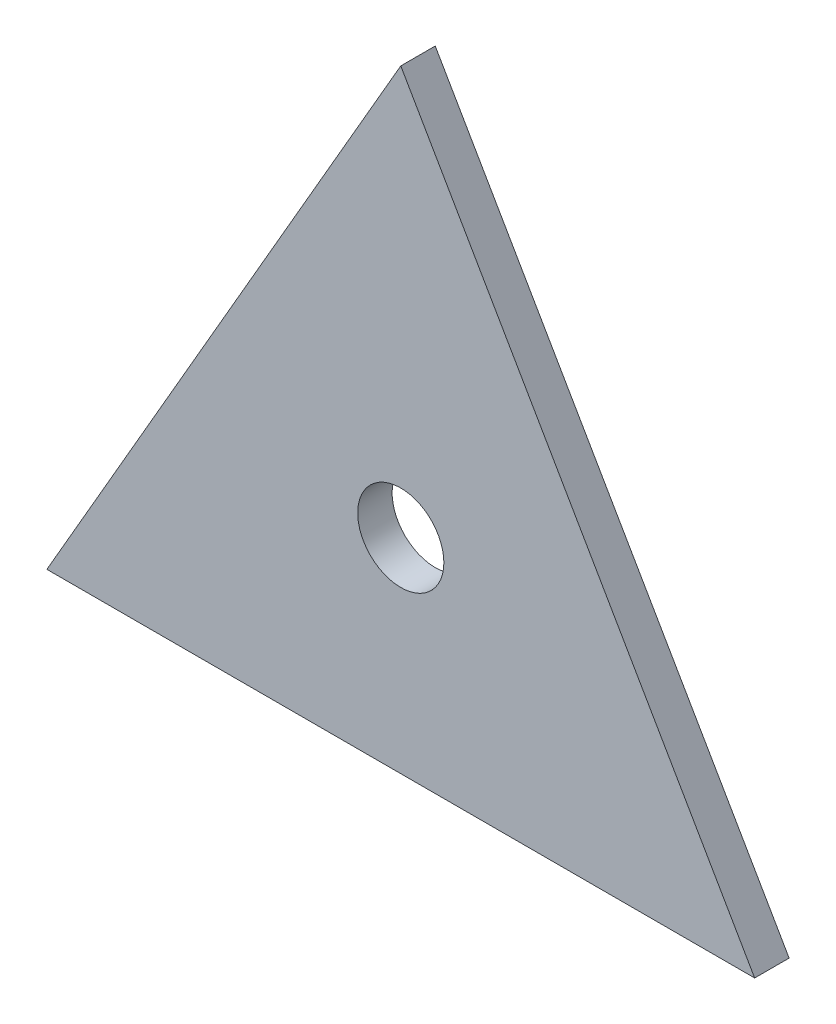
ISO-10303-21;
HEADER;
FILE_DESCRIPTION(('STEP AP214'),'2;1');
FILE_NAME('part.step','',(''),(''),'','','');
FILE_SCHEMA(('AUTOMOTIVE_DESIGN { 1 0 10303 214 1 1 1 1 }'));
ENDSEC;
DATA;
#1=APPLICATION_CONTEXT('core data for automotive mechanical design processes');
#2=APPLICATION_PROTOCOL_DEFINITION('international standard','automotive_design',2000,#1);
#3=PRODUCT_CONTEXT('',#1,'mechanical');
#4=PRODUCT('Part','Part','',(#3));
#5=PRODUCT_RELATED_PRODUCT_CATEGORY('part','',(#4));
#6=PRODUCT_DEFINITION_FORMATION('','',#4);
#7=PRODUCT_DEFINITION_CONTEXT('part definition',#1,'design');
#8=PRODUCT_DEFINITION('design','',#6,#7);
#9=PRODUCT_DEFINITION_SHAPE('','',#8);
#10=(LENGTH_UNIT() NAMED_UNIT(*) SI_UNIT(.MILLI.,.METRE.));
#11=(NAMED_UNIT(*) PLANE_ANGLE_UNIT() SI_UNIT($,.RADIAN.));
#12=(NAMED_UNIT(*) SI_UNIT($,.STERADIAN.) SOLID_ANGLE_UNIT());
#13=UNCERTAINTY_MEASURE_WITH_UNIT(LENGTH_MEASURE(1.E-05),#10,'distance_accuracy_value','');
#14=(GEOMETRIC_REPRESENTATION_CONTEXT(3) GLOBAL_UNCERTAINTY_ASSIGNED_CONTEXT((#13)) GLOBAL_UNIT_ASSIGNED_CONTEXT((#10,
#11,#12)) REPRESENTATION_CONTEXT('',''));
#15=CARTESIAN_POINT('',(0.,0.,0.));
#16=DIRECTION('',(0.,0.,1.));
#17=DIRECTION('',(1.,0.,0.));
#18=AXIS2_PLACEMENT_3D('',#15,#16,#17);
#19=CARTESIAN_POINT('',(-152.400000000001,238.564543073496,-12.7));
#20=DIRECTION('',(-0.866025403784443,0.499999999999993,0.));
#21=DIRECTION('',(-0.499999999999993,-0.866025403784443,0.));
#22=AXIS2_PLACEMENT_3D('',#19,#20,#21);
#23=PLANE('',#22);
#24=DIRECTION('',(-0.499999999999993,-0.866025403784443,0.));
#25=VECTOR('',#24,1.);
#26=CARTESIAN_POINT('',(-152.400000000001,238.564543073496,0.));
#27=LINE('',#26,#25);
#28=CARTESIAN_POINT('',(-152.400000000001,238.564543073496,0.));
#29=VERTEX_POINT('',#28);
#30=CARTESIAN_POINT('',(-282.802954743874,12.6999999999984,0.));
#31=VERTEX_POINT('',#30);
#32=EDGE_CURVE('E88',#29,#31,#27,.T.);
#33=ORIENTED_EDGE('',*,*,#32,.F.);
#34=DIRECTION('',(0.,0.,1.));
#35=VECTOR('',#34,1.);
#36=CARTESIAN_POINT('',(-152.400000000001,238.564543073496,-12.7));
#37=LINE('',#36,#35);
#38=CARTESIAN_POINT('',(-152.400000000001,238.564543073496,-12.7));
#39=VERTEX_POINT('',#38);
#40=EDGE_CURVE('E11',#39,#29,#37,.T.);
#41=ORIENTED_EDGE('',*,*,#40,.F.);
#42=DIRECTION('',(-0.499999999999993,-0.866025403784443,0.));
#43=VECTOR('',#42,1.);
#44=CARTESIAN_POINT('',(-152.400000000001,238.564543073496,-12.7));
#45=LINE('',#44,#43);
#46=CARTESIAN_POINT('',(-282.802954743874,12.6999999999984,-12.7));
#47=VERTEX_POINT('',#46);
#48=EDGE_CURVE('E77',#39,#47,#45,.T.);
#49=ORIENTED_EDGE('',*,*,#48,.T.);
#50=DIRECTION('',(0.,0.,1.));
#51=VECTOR('',#50,1.);
#52=CARTESIAN_POINT('',(-282.802954743874,12.6999999999984,-12.7));
#53=LINE('',#52,#51);
#54=EDGE_CURVE('E36',#47,#31,#53,.T.);
#55=ORIENTED_EDGE('',*,*,#54,.T.);
#56=EDGE_LOOP('',(#33,#41,#49,#55));
#57=FACE_BOUND('',#56,.T.);
#58=ADVANCED_FACE('F33',(#57),#23,.T.);
#59=CARTESIAN_POINT('',(-21.9970452561249,12.7,-12.7));
#60=DIRECTION('',(0.866025403784437,0.500000000000003,0.));
#61=DIRECTION('',(-0.500000000000003,0.866025403784437,0.));
#62=AXIS2_PLACEMENT_3D('',#59,#60,#61);
#63=PLANE('',#62);
#64=DIRECTION('',(-0.500000000000003,0.866025403784437,0.));
#65=VECTOR('',#64,1.);
#66=CARTESIAN_POINT('',(-21.9970452561249,12.7,0.));
#67=LINE('',#66,#65);
#68=CARTESIAN_POINT('',(-21.9970452561249,12.7,0.));
#69=VERTEX_POINT('',#68);
#70=EDGE_CURVE('E79',#69,#29,#67,.T.);
#71=ORIENTED_EDGE('',*,*,#70,.F.);
#72=DIRECTION('',(0.,0.,1.));
#73=VECTOR('',#72,1.);
#74=CARTESIAN_POINT('',(-21.9970452561249,12.7,-12.7));
#75=LINE('',#74,#73);
#76=CARTESIAN_POINT('',(-21.9970452561249,12.7,-12.7));
#77=VERTEX_POINT('',#76);
#78=EDGE_CURVE('E42',#77,#69,#75,.T.);
#79=ORIENTED_EDGE('',*,*,#78,.F.);
#80=DIRECTION('',(-0.500000000000003,0.866025403784437,0.));
#81=VECTOR('',#80,1.);
#82=CARTESIAN_POINT('',(-21.9970452561249,12.7,-12.7));
#83=LINE('',#82,#81);
#84=EDGE_CURVE('E74',#77,#39,#83,.T.);
#85=ORIENTED_EDGE('',*,*,#84,.T.);
#86=ORIENTED_EDGE('',*,*,#40,.T.);
#87=EDGE_LOOP('',(#71,#79,#85,#86));
#88=FACE_BOUND('',#87,.T.);
#89=ADVANCED_FACE('F92',(#88),#63,.T.);
#90=CARTESIAN_POINT('',(-282.802954743874,12.6999999999984,-12.7));
#91=DIRECTION('',(0.,-1.,0.));
#92=DIRECTION('',(1.,0.,0.));
#93=AXIS2_PLACEMENT_3D('',#90,#91,#92);
#94=PLANE('',#93);
#95=DIRECTION('',(1.,0.,0.));
#96=VECTOR('',#95,1.);
#97=CARTESIAN_POINT('',(-282.802954743874,12.6999999999984,0.));
#98=LINE('',#97,#96);
#99=EDGE_CURVE('E72',#31,#69,#98,.T.);
#100=ORIENTED_EDGE('',*,*,#99,.F.);
#101=ORIENTED_EDGE('',*,*,#54,.F.);
#102=DIRECTION('',(1.,0.,0.));
#103=VECTOR('',#102,1.);
#104=CARTESIAN_POINT('',(-282.802954743874,12.6999999999984,-12.7));
#105=LINE('',#104,#103);
#106=EDGE_CURVE('E70',#47,#77,#105,.T.);
#107=ORIENTED_EDGE('',*,*,#106,.T.);
#108=ORIENTED_EDGE('',*,*,#78,.T.);
#109=EDGE_LOOP('',(#100,#101,#107,#108));
#110=FACE_BOUND('',#109,.T.);
#111=ADVANCED_FACE('F69',(#110),#94,.T.);
#112=CARTESIAN_POINT('',(0.,0.,-12.7));
#113=DIRECTION('',(0.,0.,1.));
#114=DIRECTION('',(1.,0.,0.));
#115=AXIS2_PLACEMENT_3D('',#112,#113,#114);
#116=PLANE('',#115);
#117=CARTESIAN_POINT('',(-152.4,87.9881810244989,-12.7));
#118=DIRECTION('',(0.,0.,1.));
#119=DIRECTION('',(1.,0.,0.));
#120=AXIS2_PLACEMENT_3D('',#117,#118,#119);
#121=CIRCLE('',#120,15.875);
#122=CARTESIAN_POINT('',(-136.525,87.9881810244989,-12.7));
#123=VERTEX_POINT('',#122);
#124=EDGE_CURVE('E84',#123,#123,#121,.T.);
#125=ORIENTED_EDGE('',*,*,#124,.T.);
#126=EDGE_LOOP('',(#125));
#127=FACE_BOUND('',#126,.T.);
#128=ORIENTED_EDGE('',*,*,#48,.F.);
#129=ORIENTED_EDGE('',*,*,#84,.F.);
#130=ORIENTED_EDGE('',*,*,#106,.F.);
#131=EDGE_LOOP('',(#128,#129,#130));
#132=FACE_BOUND('',#131,.T.);
#133=ADVANCED_FACE('F76',(#127,#132),#116,.F.);
#134=CARTESIAN_POINT('',(0.,0.,0.));
#135=DIRECTION('',(0.,0.,1.));
#136=DIRECTION('',(1.,0.,0.));
#137=AXIS2_PLACEMENT_3D('',#134,#135,#136);
#138=PLANE('',#137);
#139=CARTESIAN_POINT('',(-152.4,87.9881810244989,0.));
#140=DIRECTION('',(0.,0.,1.));
#141=DIRECTION('',(1.,0.,0.));
#142=AXIS2_PLACEMENT_3D('',#139,#140,#141);
#143=CIRCLE('',#142,15.875);
#144=CARTESIAN_POINT('',(-136.525,87.9881810244989,0.));
#145=VERTEX_POINT('',#144);
#146=EDGE_CURVE('E114',#145,#145,#143,.T.);
#147=ORIENTED_EDGE('',*,*,#146,.F.);
#148=EDGE_LOOP('',(#147));
#149=FACE_BOUND('',#148,.T.);
#150=ORIENTED_EDGE('',*,*,#32,.T.);
#151=ORIENTED_EDGE('',*,*,#99,.T.);
#152=ORIENTED_EDGE('',*,*,#70,.T.);
#153=EDGE_LOOP('',(#150,#151,#152));
#154=FACE_BOUND('',#153,.T.);
#155=ADVANCED_FACE('F91',(#149,#154),#138,.T.);
#156=CARTESIAN_POINT('',(-152.4,87.9881810244989,-38.1));
#157=DIRECTION('',(0.,0.,1.));
#158=DIRECTION('',(1.,0.,0.));
#159=AXIS2_PLACEMENT_3D('',#156,#157,#158);
#160=CYLINDRICAL_SURFACE('',#159,15.875);
#161=ORIENTED_EDGE('',*,*,#146,.T.);
#162=EDGE_LOOP('',(#161));
#163=FACE_BOUND('',#162,.T.);
#164=ORIENTED_EDGE('',*,*,#124,.F.);
#165=EDGE_LOOP('',(#164));
#166=FACE_BOUND('',#165,.T.);
#167=ADVANCED_FACE('F102',(#163,#166),#160,.F.);
#168=CLOSED_SHELL('',(#58,#89,#111,#133,#155,#167));
#169=MANIFOLD_SOLID_BREP('B2',#168);
#170=ADVANCED_BREP_SHAPE_REPRESENTATION('',(#18,#169),#14);
#171=SHAPE_DEFINITION_REPRESENTATION(#9,#170);
ENDSEC;
END-ISO-10303-21;
